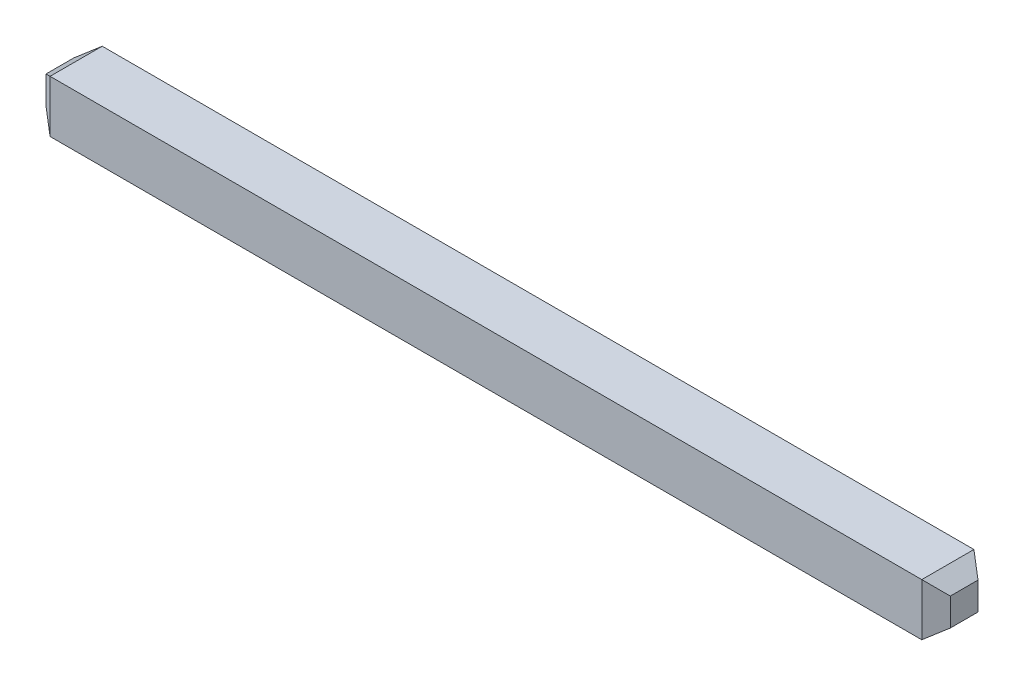
ISO-10303-21;
HEADER;
FILE_DESCRIPTION(('STEP AP214'),'2;1');
FILE_NAME('part.step','',(''),(''),'','','');
FILE_SCHEMA(('AUTOMOTIVE_DESIGN { 1 0 10303 214 1 1 1 1 }'));
ENDSEC;
DATA;
#1=APPLICATION_CONTEXT('core data for automotive mechanical design processes');
#2=APPLICATION_PROTOCOL_DEFINITION('international standard','automotive_design',2000,#1);
#3=PRODUCT_CONTEXT('',#1,'mechanical');
#4=PRODUCT('Part','Part','',(#3));
#5=PRODUCT_RELATED_PRODUCT_CATEGORY('part','',(#4));
#6=PRODUCT_DEFINITION_FORMATION('','',#4);
#7=PRODUCT_DEFINITION_CONTEXT('part definition',#1,'design');
#8=PRODUCT_DEFINITION('design','',#6,#7);
#9=PRODUCT_DEFINITION_SHAPE('','',#8);
#10=(LENGTH_UNIT() NAMED_UNIT(*) SI_UNIT(.MILLI.,.METRE.));
#11=(NAMED_UNIT(*) PLANE_ANGLE_UNIT() SI_UNIT($,.RADIAN.));
#12=(NAMED_UNIT(*) SI_UNIT($,.STERADIAN.) SOLID_ANGLE_UNIT());
#13=UNCERTAINTY_MEASURE_WITH_UNIT(LENGTH_MEASURE(1.E-05),#10,'distance_accuracy_value','');
#14=(GEOMETRIC_REPRESENTATION_CONTEXT(3) GLOBAL_UNCERTAINTY_ASSIGNED_CONTEXT((#13)) GLOBAL_UNIT_ASSIGNED_CONTEXT((#10,
#11,#12)) REPRESENTATION_CONTEXT('',''));
#15=CARTESIAN_POINT('',(0.,0.,0.));
#16=DIRECTION('',(0.,0.,1.));
#17=DIRECTION('',(1.,0.,0.));
#18=AXIS2_PLACEMENT_3D('',#15,#16,#17);
#19=CARTESIAN_POINT('',(-2.4,3.77,-4.055));
#20=DIRECTION('',(0.6,0.,0.8));
#21=DIRECTION('',(0.8,0.,-0.6));
#22=AXIS2_PLACEMENT_3D('',#19,#20,#21);
#23=PLANE('',#22);
#24=DIRECTION('',(0.,1.,0.));
#25=VECTOR('',#24,1.);
#26=CARTESIAN_POINT('',(-2.3,3.77,-4.13));
#27=LINE('',#26,#25);
#28=CARTESIAN_POINT('',(-2.3,4.09,-4.13));
#29=VERTEX_POINT('',#28);
#30=CARTESIAN_POINT('',(-2.3,3.45,-4.13));
#31=VERTEX_POINT('',#30);
#32=EDGE_CURVE('E101',#29,#31,#27,.F.);
#33=ORIENTED_EDGE('',*,*,#32,.T.);
#34=DIRECTION('',(-0.685994340570036,0.514495755427526,0.514495755427526));
#35=VECTOR('',#34,1.);
#36=CARTESIAN_POINT('',(-2.3,3.45,-4.13));
#37=LINE('',#36,#35);
#38=CARTESIAN_POINT('',(-2.5,3.6,-3.98));
#39=VERTEX_POINT('',#38);
#40=EDGE_CURVE('E85',#31,#39,#37,.T.);
#41=ORIENTED_EDGE('',*,*,#40,.T.);
#42=DIRECTION('',(0.,1.,0.));
#43=VECTOR('',#42,1.);
#44=CARTESIAN_POINT('',(-2.5,3.77,-3.98));
#45=LINE('',#44,#43);
#46=CARTESIAN_POINT('',(-2.5,3.94,-3.98));
#47=VERTEX_POINT('',#46);
#48=EDGE_CURVE('E79',#39,#47,#45,.T.);
#49=ORIENTED_EDGE('',*,*,#48,.T.);
#50=DIRECTION('',(-0.685994340570036,-0.514495755427526,0.514495755427526));
#51=VECTOR('',#50,1.);
#52=CARTESIAN_POINT('',(-2.3,4.09,-4.13));
#53=LINE('',#52,#51);
#54=EDGE_CURVE('E20',#29,#47,#53,.T.);
#55=ORIENTED_EDGE('',*,*,#54,.F.);
#56=EDGE_LOOP('',(#33,#41,#49,#55));
#57=FACE_BOUND('',#56,.T.);
#58=ADVANCED_FACE('F17',(#57),#23,.F.);
#59=CARTESIAN_POINT('',(8.5,3.77,-4.055));
#60=DIRECTION('',(-0.6,0.,0.8));
#61=DIRECTION('',(0.8,0.,0.6));
#62=AXIS2_PLACEMENT_3D('',#59,#60,#61);
#63=PLANE('',#62);
#64=DIRECTION('',(0.,1.,0.));
#65=VECTOR('',#64,1.);
#66=CARTESIAN_POINT('',(8.6,3.77,-3.98));
#67=LINE('',#66,#65);
#68=CARTESIAN_POINT('',(8.6,3.6,-3.98));
#69=VERTEX_POINT('',#68);
#70=CARTESIAN_POINT('',(8.6,3.94,-3.98));
#71=VERTEX_POINT('',#70);
#72=EDGE_CURVE('E113',#69,#71,#67,.T.);
#73=ORIENTED_EDGE('',*,*,#72,.F.);
#74=DIRECTION('',(-0.685994340570034,-0.514495755427526,-0.514495755427529));
#75=VECTOR('',#74,1.);
#76=CARTESIAN_POINT('',(8.6,3.6,-3.98));
#77=LINE('',#76,#75);
#78=CARTESIAN_POINT('',(8.4,3.45,-4.13));
#79=VERTEX_POINT('',#78);
#80=EDGE_CURVE('E108',#69,#79,#77,.T.);
#81=ORIENTED_EDGE('',*,*,#80,.T.);
#82=DIRECTION('',(0.,1.,0.));
#83=VECTOR('',#82,1.);
#84=CARTESIAN_POINT('',(8.4,3.77,-4.13));
#85=LINE('',#84,#83);
#86=CARTESIAN_POINT('',(8.4,4.09,-4.13));
#87=VERTEX_POINT('',#86);
#88=EDGE_CURVE('E99',#79,#87,#85,.T.);
#89=ORIENTED_EDGE('',*,*,#88,.T.);
#90=DIRECTION('',(-0.685994340570034,0.514495755427526,-0.514495755427529));
#91=VECTOR('',#90,1.);
#92=CARTESIAN_POINT('',(8.6,3.94,-3.98));
#93=LINE('',#92,#91);
#94=EDGE_CURVE('E116',#71,#87,#93,.T.);
#95=ORIENTED_EDGE('',*,*,#94,.F.);
#96=EDGE_LOOP('',(#73,#81,#89,#95));
#97=FACE_BOUND('',#96,.T.);
#98=ADVANCED_FACE('F214',(#97),#63,.F.);
#99=CARTESIAN_POINT('',(-2.4,4.015,-3.81));
#100=DIRECTION('',(-0.6,0.8,0.));
#101=DIRECTION('',(-0.8,-0.6,0.));
#102=AXIS2_PLACEMENT_3D('',#99,#100,#101);
#103=PLANE('',#102);
#104=DIRECTION('',(-0.685994340570036,-0.514495755427527,-0.514495755427525));
#105=VECTOR('',#104,1.);
#106=CARTESIAN_POINT('',(-2.3,4.09,-3.49));
#107=LINE('',#106,#105);
#108=CARTESIAN_POINT('',(-2.3,4.09,-3.49));
#109=VERTEX_POINT('',#108);
#110=CARTESIAN_POINT('',(-2.5,3.94,-3.64));
#111=VERTEX_POINT('',#110);
#112=EDGE_CURVE('E128',#109,#111,#107,.T.);
#113=ORIENTED_EDGE('',*,*,#112,.F.);
#114=DIRECTION('',(0.,0.,1.));
#115=VECTOR('',#114,1.);
#116=CARTESIAN_POINT('',(-2.3,4.09,-3.81));
#117=LINE('',#116,#115);
#118=EDGE_CURVE('E93',#29,#109,#117,.T.);
#119=ORIENTED_EDGE('',*,*,#118,.F.);
#120=ORIENTED_EDGE('',*,*,#54,.T.);
#121=DIRECTION('',(0.,0.,-1.));
#122=VECTOR('',#121,1.);
#123=CARTESIAN_POINT('',(-2.5,3.94,-3.81));
#124=LINE('',#123,#122);
#125=EDGE_CURVE('E87',#47,#111,#124,.F.);
#126=ORIENTED_EDGE('',*,*,#125,.T.);
#127=EDGE_LOOP('',(#113,#119,#120,#126));
#128=FACE_BOUND('',#127,.T.);
#129=ADVANCED_FACE('F90',(#128),#103,.T.);
#130=CARTESIAN_POINT('',(-2.5,3.77,-3.81));
#131=DIRECTION('',(1.,0.,0.));
#132=DIRECTION('',(0.,0.,-1.));
#133=AXIS2_PLACEMENT_3D('',#130,#131,#132);
#134=PLANE('',#133);
#135=DIRECTION('',(0.,1.,0.));
#136=VECTOR('',#135,1.);
#137=CARTESIAN_POINT('',(-2.5,3.77,-3.64));
#138=LINE('',#137,#136);
#139=CARTESIAN_POINT('',(-2.5,3.6,-3.64));
#140=VERTEX_POINT('',#139);
#141=EDGE_CURVE('E97',#111,#140,#138,.F.);
#142=ORIENTED_EDGE('',*,*,#141,.F.);
#143=ORIENTED_EDGE('',*,*,#125,.F.);
#144=ORIENTED_EDGE('',*,*,#48,.F.);
#145=DIRECTION('',(0.,0.,1.));
#146=VECTOR('',#145,1.);
#147=CARTESIAN_POINT('',(-2.5,3.6,-3.81));
#148=LINE('',#147,#146);
#149=EDGE_CURVE('E105',#39,#140,#148,.T.);
#150=ORIENTED_EDGE('',*,*,#149,.T.);
#151=EDGE_LOOP('',(#142,#143,#144,#150));
#152=FACE_BOUND('',#151,.T.);
#153=ADVANCED_FACE('F95',(#152),#134,.F.);
#154=CARTESIAN_POINT('',(3.05,3.77,-4.13));
#155=DIRECTION('',(0.,0.,1.));
#156=DIRECTION('',(1.,0.,0.));
#157=AXIS2_PLACEMENT_3D('',#154,#155,#156);
#158=PLANE('',#157);
#159=ORIENTED_EDGE('',*,*,#32,.F.);
#160=DIRECTION('',(1.,0.,0.));
#161=VECTOR('',#160,1.);
#162=CARTESIAN_POINT('',(3.05,4.09,-4.13));
#163=LINE('',#162,#161);
#164=EDGE_CURVE('E122',#87,#29,#163,.F.);
#165=ORIENTED_EDGE('',*,*,#164,.F.);
#166=ORIENTED_EDGE('',*,*,#88,.F.);
#167=DIRECTION('',(1.,0.,0.));
#168=VECTOR('',#167,1.);
#169=CARTESIAN_POINT('',(3.05,3.45,-4.13));
#170=LINE('',#169,#168);
#171=EDGE_CURVE('E136',#79,#31,#170,.F.);
#172=ORIENTED_EDGE('',*,*,#171,.T.);
#173=EDGE_LOOP('',(#159,#165,#166,#172));
#174=FACE_BOUND('',#173,.T.);
#175=ADVANCED_FACE('F182',(#174),#158,.F.);
#176=CARTESIAN_POINT('',(-2.4,3.525,-3.81));
#177=DIRECTION('',(0.6,0.8,0.));
#178=DIRECTION('',(-0.8,0.6,0.));
#179=AXIS2_PLACEMENT_3D('',#176,#177,#178);
#180=PLANE('',#179);
#181=DIRECTION('',(0.,0.,1.));
#182=VECTOR('',#181,1.);
#183=CARTESIAN_POINT('',(-2.3,3.45,-3.81));
#184=LINE('',#183,#182);
#185=CARTESIAN_POINT('',(-2.3,3.45,-3.49));
#186=VERTEX_POINT('',#185);
#187=EDGE_CURVE('E139',#31,#186,#184,.T.);
#188=ORIENTED_EDGE('',*,*,#187,.T.);
#189=DIRECTION('',(0.685994340570036,-0.514495755427527,0.514495755427525));
#190=VECTOR('',#189,1.);
#191=CARTESIAN_POINT('',(-2.5,3.6,-3.64));
#192=LINE('',#191,#190);
#193=EDGE_CURVE('E131',#140,#186,#192,.T.);
#194=ORIENTED_EDGE('',*,*,#193,.F.);
#195=ORIENTED_EDGE('',*,*,#149,.F.);
#196=ORIENTED_EDGE('',*,*,#40,.F.);
#197=EDGE_LOOP('',(#188,#194,#195,#196));
#198=FACE_BOUND('',#197,.T.);
#199=ADVANCED_FACE('F179',(#198),#180,.F.);
#200=CARTESIAN_POINT('',(8.5,3.525,-3.81));
#201=DIRECTION('',(-0.6,0.8,0.));
#202=DIRECTION('',(-0.8,-0.6,0.));
#203=AXIS2_PLACEMENT_3D('',#200,#201,#202);
#204=PLANE('',#203);
#205=DIRECTION('',(0.,0.,-1.));
#206=VECTOR('',#205,1.);
#207=CARTESIAN_POINT('',(8.6,3.6,-3.81));
#208=LINE('',#207,#206);
#209=CARTESIAN_POINT('',(8.6,3.6,-3.64));
#210=VERTEX_POINT('',#209);
#211=EDGE_CURVE('E110',#210,#69,#208,.T.);
#212=ORIENTED_EDGE('',*,*,#211,.F.);
#213=DIRECTION('',(0.685994340570034,0.514495755427529,-0.514495755427526));
#214=VECTOR('',#213,1.);
#215=CARTESIAN_POINT('',(8.4,3.45,-3.49));
#216=LINE('',#215,#214);
#217=CARTESIAN_POINT('',(8.4,3.45,-3.49));
#218=VERTEX_POINT('',#217);
#219=EDGE_CURVE('E35',#218,#210,#216,.T.);
#220=ORIENTED_EDGE('',*,*,#219,.F.);
#221=DIRECTION('',(0.,0.,1.));
#222=VECTOR('',#221,1.);
#223=CARTESIAN_POINT('',(8.4,3.45,-3.81));
#224=LINE('',#223,#222);
#225=EDGE_CURVE('E134',#218,#79,#224,.F.);
#226=ORIENTED_EDGE('',*,*,#225,.T.);
#227=ORIENTED_EDGE('',*,*,#80,.F.);
#228=EDGE_LOOP('',(#212,#220,#226,#227));
#229=FACE_BOUND('',#228,.T.);
#230=ADVANCED_FACE('F181',(#229),#204,.F.);
#231=CARTESIAN_POINT('',(8.6,3.77,-3.81));
#232=DIRECTION('',(1.,0.,0.));
#233=DIRECTION('',(0.,0.,-1.));
#234=AXIS2_PLACEMENT_3D('',#231,#232,#233);
#235=PLANE('',#234);
#236=ORIENTED_EDGE('',*,*,#72,.T.);
#237=DIRECTION('',(0.,0.,1.));
#238=VECTOR('',#237,1.);
#239=CARTESIAN_POINT('',(8.6,3.94,-3.81));
#240=LINE('',#239,#238);
#241=CARTESIAN_POINT('',(8.6,3.94,-3.64));
#242=VERTEX_POINT('',#241);
#243=EDGE_CURVE('E119',#242,#71,#240,.F.);
#244=ORIENTED_EDGE('',*,*,#243,.F.);
#245=DIRECTION('',(0.,1.,0.));
#246=VECTOR('',#245,1.);
#247=CARTESIAN_POINT('',(8.6,3.77,-3.64));
#248=LINE('',#247,#246);
#249=EDGE_CURVE('E142',#210,#242,#248,.T.);
#250=ORIENTED_EDGE('',*,*,#249,.F.);
#251=ORIENTED_EDGE('',*,*,#211,.T.);
#252=EDGE_LOOP('',(#236,#244,#250,#251));
#253=FACE_BOUND('',#252,.T.);
#254=ADVANCED_FACE('F189',(#253),#235,.T.);
#255=CARTESIAN_POINT('',(8.5,4.015,-3.81));
#256=DIRECTION('',(0.6,0.8,0.));
#257=DIRECTION('',(-0.8,0.6,0.));
#258=AXIS2_PLACEMENT_3D('',#255,#256,#257);
#259=PLANE('',#258);
#260=DIRECTION('',(-0.685994340570034,0.514495755427529,0.514495755427526));
#261=VECTOR('',#260,1.);
#262=CARTESIAN_POINT('',(8.6,3.94,-3.64));
#263=LINE('',#262,#261);
#264=CARTESIAN_POINT('',(8.4,4.09,-3.49));
#265=VERTEX_POINT('',#264);
#266=EDGE_CURVE('E145',#242,#265,#263,.T.);
#267=ORIENTED_EDGE('',*,*,#266,.F.);
#268=ORIENTED_EDGE('',*,*,#243,.T.);
#269=ORIENTED_EDGE('',*,*,#94,.T.);
#270=DIRECTION('',(0.,0.,1.));
#271=VECTOR('',#270,1.);
#272=CARTESIAN_POINT('',(8.4,4.09,-3.81));
#273=LINE('',#272,#271);
#274=EDGE_CURVE('E125',#265,#87,#273,.F.);
#275=ORIENTED_EDGE('',*,*,#274,.F.);
#276=EDGE_LOOP('',(#267,#268,#269,#275));
#277=FACE_BOUND('',#276,.T.);
#278=ADVANCED_FACE('F170',(#277),#259,.T.);
#279=CARTESIAN_POINT('',(3.05,4.09,-3.81));
#280=DIRECTION('',(0.,1.,0.));
#281=DIRECTION('',(0.,0.,1.));
#282=AXIS2_PLACEMENT_3D('',#279,#280,#281);
#283=PLANE('',#282);
#284=DIRECTION('',(1.,0.,0.));
#285=VECTOR('',#284,1.);
#286=CARTESIAN_POINT('',(3.05,4.09,-3.49));
#287=LINE('',#286,#285);
#288=EDGE_CURVE('E148',#265,#109,#287,.F.);
#289=ORIENTED_EDGE('',*,*,#288,.F.);
#290=ORIENTED_EDGE('',*,*,#274,.T.);
#291=ORIENTED_EDGE('',*,*,#164,.T.);
#292=ORIENTED_EDGE('',*,*,#118,.T.);
#293=EDGE_LOOP('',(#289,#290,#291,#292));
#294=FACE_BOUND('',#293,.T.);
#295=ADVANCED_FACE('F173',(#294),#283,.T.);
#296=CARTESIAN_POINT('',(-2.4,3.77,-3.565));
#297=DIRECTION('',(-0.6,0.,0.8));
#298=DIRECTION('',(0.8,0.,0.6));
#299=AXIS2_PLACEMENT_3D('',#296,#297,#298);
#300=PLANE('',#299);
#301=ORIENTED_EDGE('',*,*,#193,.T.);
#302=DIRECTION('',(0.,1.,0.));
#303=VECTOR('',#302,1.);
#304=CARTESIAN_POINT('',(-2.3,3.77,-3.49));
#305=LINE('',#304,#303);
#306=EDGE_CURVE('E151',#109,#186,#305,.F.);
#307=ORIENTED_EDGE('',*,*,#306,.F.);
#308=ORIENTED_EDGE('',*,*,#112,.T.);
#309=ORIENTED_EDGE('',*,*,#141,.T.);
#310=EDGE_LOOP('',(#301,#307,#308,#309));
#311=FACE_BOUND('',#310,.T.);
#312=ADVANCED_FACE('F176',(#311),#300,.T.);
#313=CARTESIAN_POINT('',(3.05,3.45,-3.81));
#314=DIRECTION('',(0.,1.,0.));
#315=DIRECTION('',(0.,0.,1.));
#316=AXIS2_PLACEMENT_3D('',#313,#314,#315);
#317=PLANE('',#316);
#318=ORIENTED_EDGE('',*,*,#187,.F.);
#319=ORIENTED_EDGE('',*,*,#171,.F.);
#320=ORIENTED_EDGE('',*,*,#225,.F.);
#321=DIRECTION('',(1.,0.,0.));
#322=VECTOR('',#321,1.);
#323=CARTESIAN_POINT('',(3.05,3.45,-3.49));
#324=LINE('',#323,#322);
#325=EDGE_CURVE('E26',#186,#218,#324,.T.);
#326=ORIENTED_EDGE('',*,*,#325,.F.);
#327=EDGE_LOOP('',(#318,#319,#320,#326));
#328=FACE_BOUND('',#327,.T.);
#329=ADVANCED_FACE('F162',(#328),#317,.F.);
#330=CARTESIAN_POINT('',(8.5,3.77,-3.565));
#331=DIRECTION('',(0.6,0.,0.8));
#332=DIRECTION('',(0.8,0.,-0.6));
#333=AXIS2_PLACEMENT_3D('',#330,#331,#332);
#334=PLANE('',#333);
#335=ORIENTED_EDGE('',*,*,#266,.T.);
#336=DIRECTION('',(0.,1.,0.));
#337=VECTOR('',#336,1.);
#338=CARTESIAN_POINT('',(8.4,3.77,-3.49));
#339=LINE('',#338,#337);
#340=EDGE_CURVE('E11',#218,#265,#339,.T.);
#341=ORIENTED_EDGE('',*,*,#340,.F.);
#342=ORIENTED_EDGE('',*,*,#219,.T.);
#343=ORIENTED_EDGE('',*,*,#249,.T.);
#344=EDGE_LOOP('',(#335,#341,#342,#343));
#345=FACE_BOUND('',#344,.T.);
#346=ADVANCED_FACE('F166',(#345),#334,.T.);
#347=CARTESIAN_POINT('',(3.05,3.77,-3.49));
#348=DIRECTION('',(0.,0.,1.));
#349=DIRECTION('',(1.,0.,0.));
#350=AXIS2_PLACEMENT_3D('',#347,#348,#349);
#351=PLANE('',#350);
#352=ORIENTED_EDGE('',*,*,#325,.T.);
#353=ORIENTED_EDGE('',*,*,#340,.T.);
#354=ORIENTED_EDGE('',*,*,#288,.T.);
#355=ORIENTED_EDGE('',*,*,#306,.T.);
#356=EDGE_LOOP('',(#352,#353,#354,#355));
#357=FACE_BOUND('',#356,.T.);
#358=ADVANCED_FACE('F157',(#357),#351,.T.);
#359=CLOSED_SHELL('',(#58,#98,#129,#153,#175,#199,#230,#254,#278,#295,#312,#329,#346,#358));
#360=MANIFOLD_SOLID_BREP('B1',#359);
#361=ADVANCED_BREP_SHAPE_REPRESENTATION('',(#18,#360),#14);
#362=SHAPE_DEFINITION_REPRESENTATION(#9,#361);
ENDSEC;
END-ISO-10303-21;
